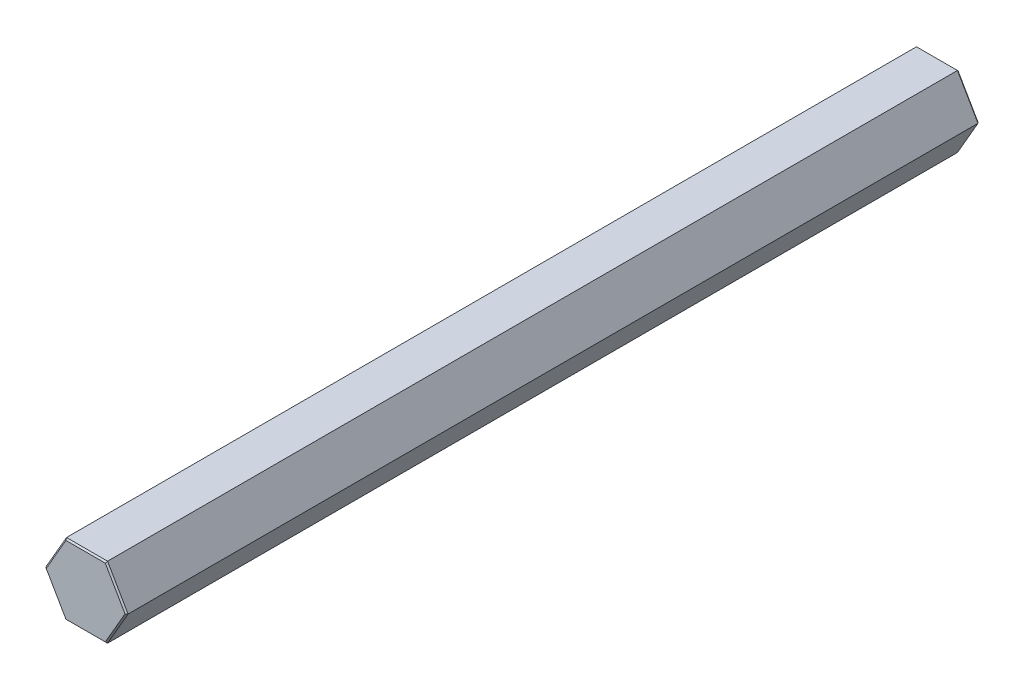
ISO-10303-21;
HEADER;
FILE_DESCRIPTION(('STEP AP214'),'2;1');
FILE_NAME('part.step','',(''),(''),'','','');
FILE_SCHEMA(('AUTOMOTIVE_DESIGN { 1 0 10303 214 1 1 1 1 }'));
ENDSEC;
DATA;
#1=APPLICATION_CONTEXT('core data for automotive mechanical design processes');
#2=APPLICATION_PROTOCOL_DEFINITION('international standard','automotive_design',2000,#1);
#3=PRODUCT_CONTEXT('',#1,'mechanical');
#4=PRODUCT('Part','Part','',(#3));
#5=PRODUCT_RELATED_PRODUCT_CATEGORY('part','',(#4));
#6=PRODUCT_DEFINITION_FORMATION('','',#4);
#7=PRODUCT_DEFINITION_CONTEXT('part definition',#1,'design');
#8=PRODUCT_DEFINITION('design','',#6,#7);
#9=PRODUCT_DEFINITION_SHAPE('','',#8);
#10=(LENGTH_UNIT() NAMED_UNIT(*) SI_UNIT(.MILLI.,.METRE.));
#11=(NAMED_UNIT(*) PLANE_ANGLE_UNIT() SI_UNIT($,.RADIAN.));
#12=(NAMED_UNIT(*) SI_UNIT($,.STERADIAN.) SOLID_ANGLE_UNIT());
#13=UNCERTAINTY_MEASURE_WITH_UNIT(LENGTH_MEASURE(1.E-05),#10,'distance_accuracy_value','');
#14=(GEOMETRIC_REPRESENTATION_CONTEXT(3) GLOBAL_UNCERTAINTY_ASSIGNED_CONTEXT((#13)) GLOBAL_UNIT_ASSIGNED_CONTEXT((#10,
#11,#12)) REPRESENTATION_CONTEXT('',''));
#15=CARTESIAN_POINT('',(0.,0.,0.));
#16=DIRECTION('',(0.,0.,1.));
#17=DIRECTION('',(1.,0.,0.));
#18=AXIS2_PLACEMENT_3D('',#15,#16,#17);
#19=CARTESIAN_POINT('',(-7.33234841870824,0.,152.4));
#20=DIRECTION('',(-0.866025403784439,0.5,0.));
#21=DIRECTION('',(-0.5,-0.866025403784439,0.));
#22=AXIS2_PLACEMENT_3D('',#19,#20,#21);
#23=PLANE('',#22);
#24=DIRECTION('',(0.,0.,-1.));
#25=VECTOR('',#24,1.);
#26=CARTESIAN_POINT('',(-3.66617420935412,6.35,152.4));
#27=LINE('',#26,#25);
#28=CARTESIAN_POINT('',(-3.66617420935412,6.35,152.146));
#29=VERTEX_POINT('',#28);
#30=CARTESIAN_POINT('',(-3.66617420935412,6.35,0.25400000000006));
#31=VERTEX_POINT('',#30);
#32=EDGE_CURVE('E156',#29,#31,#27,.T.);
#33=ORIENTED_EDGE('',*,*,#32,.T.);
#34=DIRECTION('',(-0.5,-0.866025403784439,0.));
#35=VECTOR('',#34,1.);
#36=CARTESIAN_POINT('',(-7.33234841870824,0.,0.254000000000004));
#37=LINE('',#36,#35);
#38=CARTESIAN_POINT('',(-7.33234841870824,0.,0.25400000000006));
#39=VERTEX_POINT('',#38);
#40=EDGE_CURVE('E153',#31,#39,#37,.T.);
#41=ORIENTED_EDGE('',*,*,#40,.T.);
#42=DIRECTION('',(0.,0.,-1.));
#43=VECTOR('',#42,1.);
#44=CARTESIAN_POINT('',(-7.33234841870824,0.,152.4));
#45=LINE('',#44,#43);
#46=CARTESIAN_POINT('',(-7.33234841870824,0.,152.146));
#47=VERTEX_POINT('',#46);
#48=EDGE_CURVE('E150',#47,#39,#45,.T.);
#49=ORIENTED_EDGE('',*,*,#48,.F.);
#50=DIRECTION('',(0.5,0.866025403784439,0.));
#51=VECTOR('',#50,1.);
#52=CARTESIAN_POINT('',(-3.66617420935412,6.35,152.146));
#53=LINE('',#52,#51);
#54=EDGE_CURVE('E210',#47,#29,#53,.T.);
#55=ORIENTED_EDGE('',*,*,#54,.T.);
#56=EDGE_LOOP('',(#33,#41,#49,#55));
#57=FACE_BOUND('',#56,.T.);
#58=ADVANCED_FACE('F35',(#57),#23,.T.);
#59=CARTESIAN_POINT('',(-3.66617420935412,-6.35,152.4));
#60=DIRECTION('',(-0.866025403784439,-0.5,0.));
#61=DIRECTION('',(0.5,-0.866025403784439,0.));
#62=AXIS2_PLACEMENT_3D('',#59,#60,#61);
#63=PLANE('',#62);
#64=ORIENTED_EDGE('',*,*,#48,.T.);
#65=DIRECTION('',(0.5,-0.866025403784439,0.));
#66=VECTOR('',#65,1.);
#67=CARTESIAN_POINT('',(-3.66617420935412,-6.35,0.254000000000004));
#68=LINE('',#67,#66);
#69=CARTESIAN_POINT('',(-3.66617420935412,-6.35,0.25400000000006));
#70=VERTEX_POINT('',#69);
#71=EDGE_CURVE('E194',#39,#70,#68,.T.);
#72=ORIENTED_EDGE('',*,*,#71,.T.);
#73=DIRECTION('',(0.,0.,-1.));
#74=VECTOR('',#73,1.);
#75=CARTESIAN_POINT('',(-3.66617420935412,-6.35,152.4));
#76=LINE('',#75,#74);
#77=CARTESIAN_POINT('',(-3.66617420935412,-6.35,152.146));
#78=VERTEX_POINT('',#77);
#79=EDGE_CURVE('E273',#78,#70,#76,.T.);
#80=ORIENTED_EDGE('',*,*,#79,.F.);
#81=DIRECTION('',(-0.5,0.866025403784439,0.));
#82=VECTOR('',#81,1.);
#83=CARTESIAN_POINT('',(-7.33234841870824,0.,152.146));
#84=LINE('',#83,#82);
#85=EDGE_CURVE('E200',#78,#47,#84,.T.);
#86=ORIENTED_EDGE('',*,*,#85,.T.);
#87=EDGE_LOOP('',(#64,#72,#80,#86));
#88=FACE_BOUND('',#87,.T.);
#89=ADVANCED_FACE('F276',(#88),#63,.T.);
#90=CARTESIAN_POINT('',(3.66617420935413,-6.35,152.4));
#91=DIRECTION('',(0.,-1.,0.));
#92=DIRECTION('',(0.,0.,-1.));
#93=AXIS2_PLACEMENT_3D('',#90,#91,#92);
#94=PLANE('',#93);
#95=ORIENTED_EDGE('',*,*,#79,.T.);
#96=DIRECTION('',(1.,0.,0.));
#97=VECTOR('',#96,1.);
#98=CARTESIAN_POINT('',(3.66617420935413,-6.35,0.254000000000004));
#99=LINE('',#98,#97);
#100=CARTESIAN_POINT('',(3.66617420935413,-6.35,0.25400000000006));
#101=VERTEX_POINT('',#100);
#102=EDGE_CURVE('E233',#70,#101,#99,.T.);
#103=ORIENTED_EDGE('',*,*,#102,.T.);
#104=DIRECTION('',(0.,0.,-1.));
#105=VECTOR('',#104,1.);
#106=CARTESIAN_POINT('',(3.66617420935413,-6.35,152.4));
#107=LINE('',#106,#105);
#108=CARTESIAN_POINT('',(3.66617420935413,-6.35,152.146));
#109=VERTEX_POINT('',#108);
#110=EDGE_CURVE('E250',#109,#101,#107,.T.);
#111=ORIENTED_EDGE('',*,*,#110,.F.);
#112=DIRECTION('',(-1.,0.,0.));
#113=VECTOR('',#112,1.);
#114=CARTESIAN_POINT('',(-3.66617420935412,-6.35,152.146));
#115=LINE('',#114,#113);
#116=EDGE_CURVE('E230',#109,#78,#115,.T.);
#117=ORIENTED_EDGE('',*,*,#116,.T.);
#118=EDGE_LOOP('',(#95,#103,#111,#117));
#119=FACE_BOUND('',#118,.T.);
#120=ADVANCED_FACE('F301',(#119),#94,.T.);
#121=CARTESIAN_POINT('',(7.33234841870825,0.,152.4));
#122=DIRECTION('',(0.866025403784439,-0.5,0.));
#123=DIRECTION('',(0.5,0.866025403784439,0.));
#124=AXIS2_PLACEMENT_3D('',#121,#122,#123);
#125=PLANE('',#124);
#126=ORIENTED_EDGE('',*,*,#110,.T.);
#127=DIRECTION('',(0.5,0.866025403784439,0.));
#128=VECTOR('',#127,1.);
#129=CARTESIAN_POINT('',(7.33234841870825,0.,0.254000000000004));
#130=LINE('',#129,#128);
#131=CARTESIAN_POINT('',(7.33234841870825,0.,0.25400000000006));
#132=VERTEX_POINT('',#131);
#133=EDGE_CURVE('E205',#101,#132,#130,.T.);
#134=ORIENTED_EDGE('',*,*,#133,.T.);
#135=DIRECTION('',(0.,0.,-1.));
#136=VECTOR('',#135,1.);
#137=CARTESIAN_POINT('',(7.33234841870825,0.,152.4));
#138=LINE('',#137,#136);
#139=CARTESIAN_POINT('',(7.33234841870825,0.,152.146));
#140=VERTEX_POINT('',#139);
#141=EDGE_CURVE('E249',#140,#132,#138,.T.);
#142=ORIENTED_EDGE('',*,*,#141,.F.);
#143=DIRECTION('',(-0.5,-0.866025403784439,0.));
#144=VECTOR('',#143,1.);
#145=CARTESIAN_POINT('',(3.66617420935413,-6.35,152.146));
#146=LINE('',#145,#144);
#147=EDGE_CURVE('E237',#140,#109,#146,.T.);
#148=ORIENTED_EDGE('',*,*,#147,.T.);
#149=EDGE_LOOP('',(#126,#134,#142,#148));
#150=FACE_BOUND('',#149,.T.);
#151=ADVANCED_FACE('F248',(#150),#125,.T.);
#152=CARTESIAN_POINT('',(3.66617420935413,6.35,152.4));
#153=DIRECTION('',(0.866025403784439,0.5,0.));
#154=DIRECTION('',(-0.5,0.866025403784439,0.));
#155=AXIS2_PLACEMENT_3D('',#152,#153,#154);
#156=PLANE('',#155);
#157=ORIENTED_EDGE('',*,*,#141,.T.);
#158=DIRECTION('',(-0.5,0.866025403784439,0.));
#159=VECTOR('',#158,1.);
#160=CARTESIAN_POINT('',(3.66617420935413,6.35,0.254000000000004));
#161=LINE('',#160,#159);
#162=CARTESIAN_POINT('',(3.66617420935413,6.35,0.25400000000006));
#163=VERTEX_POINT('',#162);
#164=EDGE_CURVE('E202',#132,#163,#161,.T.);
#165=ORIENTED_EDGE('',*,*,#164,.T.);
#166=DIRECTION('',(0.,0.,-1.));
#167=VECTOR('',#166,1.);
#168=CARTESIAN_POINT('',(3.66617420935413,6.35,152.4));
#169=LINE('',#168,#167);
#170=CARTESIAN_POINT('',(3.66617420935413,6.35,152.146));
#171=VERTEX_POINT('',#170);
#172=EDGE_CURVE('E259',#171,#163,#169,.T.);
#173=ORIENTED_EDGE('',*,*,#172,.F.);
#174=DIRECTION('',(0.5,-0.866025403784439,0.));
#175=VECTOR('',#174,1.);
#176=CARTESIAN_POINT('',(7.33234841870825,0.,152.146));
#177=LINE('',#176,#175);
#178=EDGE_CURVE('E199',#171,#140,#177,.T.);
#179=ORIENTED_EDGE('',*,*,#178,.T.);
#180=EDGE_LOOP('',(#157,#165,#173,#179));
#181=FACE_BOUND('',#180,.T.);
#182=ADVANCED_FACE('F255',(#181),#156,.T.);
#183=CARTESIAN_POINT('',(-3.66617420935412,6.35,152.4));
#184=DIRECTION('',(0.,1.,0.));
#185=DIRECTION('',(0.,0.,1.));
#186=AXIS2_PLACEMENT_3D('',#183,#184,#185);
#187=PLANE('',#186);
#188=ORIENTED_EDGE('',*,*,#172,.T.);
#189=DIRECTION('',(-1.,0.,0.));
#190=VECTOR('',#189,1.);
#191=CARTESIAN_POINT('',(-3.66617420935412,6.35,0.254000000000004));
#192=LINE('',#191,#190);
#193=EDGE_CURVE('E215',#163,#31,#192,.T.);
#194=ORIENTED_EDGE('',*,*,#193,.T.);
#195=ORIENTED_EDGE('',*,*,#32,.F.);
#196=DIRECTION('',(1.,0.,0.));
#197=VECTOR('',#196,1.);
#198=CARTESIAN_POINT('',(3.66617420935413,6.35,152.146));
#199=LINE('',#198,#197);
#200=EDGE_CURVE('E213',#29,#171,#199,.T.);
#201=ORIENTED_EDGE('',*,*,#200,.T.);
#202=EDGE_LOOP('',(#188,#194,#195,#201));
#203=FACE_BOUND('',#202,.T.);
#204=ADVANCED_FACE('F281',(#203),#187,.T.);
#205=CARTESIAN_POINT('',(0.,0.,152.4));
#206=DIRECTION('',(0.,0.,-1.));
#207=DIRECTION('',(-1.,0.,0.));
#208=AXIS2_PLACEMENT_3D('',#205,#206,#207);
#209=PLANE('',#208);
#210=DIRECTION('',(-0.5,-0.866025403784439,0.));
#211=VECTOR('',#210,1.);
#212=CARTESIAN_POINT('',(-7.11237796614695,-0.127000000000026,152.4));
#213=LINE('',#212,#211);
#214=CARTESIAN_POINT('',(-3.51952724097992,6.09599999999994,152.4));
#215=VERTEX_POINT('',#214);
#216=CARTESIAN_POINT('',(-7.03905448195985,0.,152.4));
#217=VERTEX_POINT('',#216);
#218=EDGE_CURVE('E60',#215,#217,#213,.T.);
#219=ORIENTED_EDGE('',*,*,#218,.T.);
#220=DIRECTION('',(0.5,-0.866025403784439,0.));
#221=VECTOR('',#220,1.);
#222=CARTESIAN_POINT('',(-3.44620375679282,-6.22299999999997,152.4));
#223=LINE('',#222,#221);
#224=CARTESIAN_POINT('',(-3.51952724097992,-6.09599999999994,152.4));
#225=VERTEX_POINT('',#224);
#226=EDGE_CURVE('E11',#217,#225,#223,.T.);
#227=ORIENTED_EDGE('',*,*,#226,.T.);
#228=DIRECTION('',(1.,0.,0.));
#229=VECTOR('',#228,1.);
#230=CARTESIAN_POINT('',(3.66617420935413,-6.09599999999994,152.4));
#231=LINE('',#230,#229);
#232=CARTESIAN_POINT('',(3.51952724097993,-6.09599999999994,152.4));
#233=VERTEX_POINT('',#232);
#234=EDGE_CURVE('E45',#225,#233,#231,.T.);
#235=ORIENTED_EDGE('',*,*,#234,.T.);
#236=DIRECTION('',(0.5,0.866025403784439,0.));
#237=VECTOR('',#236,1.);
#238=CARTESIAN_POINT('',(7.11237796614695,0.127000000000031,152.4));
#239=LINE('',#238,#237);
#240=CARTESIAN_POINT('',(7.03905448195985,0.,152.4));
#241=VERTEX_POINT('',#240);
#242=EDGE_CURVE('E221',#233,#241,#239,.T.);
#243=ORIENTED_EDGE('',*,*,#242,.T.);
#244=DIRECTION('',(-0.5,0.866025403784439,0.));
#245=VECTOR('',#244,1.);
#246=CARTESIAN_POINT('',(3.44620375679283,6.22299999999997,152.4));
#247=LINE('',#246,#245);
#248=CARTESIAN_POINT('',(3.51952724097993,6.09599999999994,152.4));
#249=VERTEX_POINT('',#248);
#250=EDGE_CURVE('E217',#241,#249,#247,.T.);
#251=ORIENTED_EDGE('',*,*,#250,.T.);
#252=DIRECTION('',(-1.,0.,0.));
#253=VECTOR('',#252,1.);
#254=CARTESIAN_POINT('',(-3.66617420935412,6.09599999999994,152.4));
#255=LINE('',#254,#253);
#256=EDGE_CURVE('E219',#249,#215,#255,.T.);
#257=ORIENTED_EDGE('',*,*,#256,.T.);
#258=EDGE_LOOP('',(#219,#227,#235,#243,#251,#257));
#259=FACE_BOUND('',#258,.T.);
#260=ADVANCED_FACE('F223',(#259),#209,.F.);
#261=CARTESIAN_POINT('',(0.,0.,0.));
#262=DIRECTION('',(0.,0.,-1.));
#263=DIRECTION('',(-1.,0.,0.));
#264=AXIS2_PLACEMENT_3D('',#261,#262,#263);
#265=PLANE('',#264);
#266=DIRECTION('',(-0.5,-0.866025403784439,0.));
#267=VECTOR('',#266,1.);
#268=CARTESIAN_POINT('',(5.27929086146992,-3.04799999999999,0.));
#269=LINE('',#268,#267);
#270=CARTESIAN_POINT('',(7.0390544819599,0.,0.));
#271=VERTEX_POINT('',#270);
#272=CARTESIAN_POINT('',(3.51952724097995,-6.09599999999998,0.));
#273=VERTEX_POINT('',#272);
#274=EDGE_CURVE('E239',#271,#273,#269,.T.);
#275=ORIENTED_EDGE('',*,*,#274,.T.);
#276=DIRECTION('',(-1.,0.,0.));
#277=VECTOR('',#276,1.);
#278=CARTESIAN_POINT('',(0.,-6.09599999999998,0.));
#279=LINE('',#278,#277);
#280=CARTESIAN_POINT('',(-3.51952724097994,-6.09599999999998,0.));
#281=VERTEX_POINT('',#280);
#282=EDGE_CURVE('E234',#273,#281,#279,.T.);
#283=ORIENTED_EDGE('',*,*,#282,.T.);
#284=DIRECTION('',(-0.5,0.866025403784439,0.));
#285=VECTOR('',#284,1.);
#286=CARTESIAN_POINT('',(-5.27929086146992,-3.04799999999999,0.));
#287=LINE('',#286,#285);
#288=CARTESIAN_POINT('',(-7.03905448195989,0.,0.));
#289=VERTEX_POINT('',#288);
#290=EDGE_CURVE('E134',#281,#289,#287,.T.);
#291=ORIENTED_EDGE('',*,*,#290,.T.);
#292=DIRECTION('',(0.5,0.866025403784439,0.));
#293=VECTOR('',#292,1.);
#294=CARTESIAN_POINT('',(-5.27929086146992,3.04799999999999,0.));
#295=LINE('',#294,#293);
#296=CARTESIAN_POINT('',(-3.51952724097994,6.09599999999998,0.));
#297=VERTEX_POINT('',#296);
#298=EDGE_CURVE('E127',#289,#297,#295,.T.);
#299=ORIENTED_EDGE('',*,*,#298,.T.);
#300=DIRECTION('',(1.,0.,0.));
#301=VECTOR('',#300,1.);
#302=CARTESIAN_POINT('',(0.,6.09599999999998,0.));
#303=LINE('',#302,#301);
#304=CARTESIAN_POINT('',(3.51952724097995,6.09599999999998,0.));
#305=VERTEX_POINT('',#304);
#306=EDGE_CURVE('E130',#297,#305,#303,.T.);
#307=ORIENTED_EDGE('',*,*,#306,.T.);
#308=DIRECTION('',(0.5,-0.866025403784439,0.));
#309=VECTOR('',#308,1.);
#310=CARTESIAN_POINT('',(5.27929086146993,3.04799999999999,0.));
#311=LINE('',#310,#309);
#312=EDGE_CURVE('E139',#305,#271,#311,.T.);
#313=ORIENTED_EDGE('',*,*,#312,.T.);
#314=EDGE_LOOP('',(#275,#283,#291,#299,#307,#313));
#315=FACE_BOUND('',#314,.T.);
#316=ADVANCED_FACE('F129',(#315),#265,.T.);
#317=CARTESIAN_POINT('',(0.,6.09599999999998,0.));
#318=DIRECTION('',(0.,-0.707106781186528,0.707106781186567));
#319=DIRECTION('',(1.,0.,0.));
#320=AXIS2_PLACEMENT_3D('',#317,#318,#319);
#321=PLANE('',#320);
#322=DIRECTION('',(-0.377964473009234,0.654653670707993,0.654653670707957));
#323=VECTOR('',#322,1.);
#324=CARTESIAN_POINT('',(-3.01673763512565,5.22514285714281,-0.870857142857128));
#325=LINE('',#324,#323);
#326=EDGE_CURVE('E145',#31,#297,#325,.F.);
#327=ORIENTED_EDGE('',*,*,#326,.F.);
#328=ORIENTED_EDGE('',*,*,#193,.F.);
#329=DIRECTION('',(-0.377964473009238,-0.654653670707992,-0.654653670707956));
#330=VECTOR('',#329,1.);
#331=CARTESIAN_POINT('',(3.01673763512565,5.2251428571428,-0.870857142857138));
#332=LINE('',#331,#330);
#333=EDGE_CURVE('E148',#305,#163,#332,.F.);
#334=ORIENTED_EDGE('',*,*,#333,.F.);
#335=ORIENTED_EDGE('',*,*,#306,.F.);
#336=EDGE_LOOP('',(#327,#328,#334,#335));
#337=FACE_BOUND('',#336,.T.);
#338=ADVANCED_FACE('F143',(#337),#321,.F.);
#339=CARTESIAN_POINT('',(5.27929086146993,3.04799999999999,0.));
#340=DIRECTION('',(-0.612372435695777,-0.353553390593263,0.707106781186568));
#341=DIRECTION('',(0.5,-0.866025403784439,0.));
#342=AXIS2_PLACEMENT_3D('',#339,#340,#341);
#343=PLANE('',#342);
#344=ORIENTED_EDGE('',*,*,#333,.T.);
#345=ORIENTED_EDGE('',*,*,#164,.F.);
#346=DIRECTION('',(-0.755928946018472,0.,-0.654653670707956));
#347=VECTOR('',#346,1.);
#348=CARTESIAN_POINT('',(6.0334752702513,0.,-0.87085714285713));
#349=LINE('',#348,#347);
#350=EDGE_CURVE('E154',#271,#132,#349,.F.);
#351=ORIENTED_EDGE('',*,*,#350,.F.);
#352=ORIENTED_EDGE('',*,*,#312,.F.);
#353=EDGE_LOOP('',(#344,#345,#351,#352));
#354=FACE_BOUND('',#353,.T.);
#355=ADVANCED_FACE('F263',(#354),#343,.F.);
#356=CARTESIAN_POINT('',(-5.27929086146992,3.04799999999999,0.));
#357=DIRECTION('',(0.612372435695779,-0.353553390593265,0.707106781186566));
#358=DIRECTION('',(0.5,0.866025403784439,0.));
#359=AXIS2_PLACEMENT_3D('',#356,#357,#358);
#360=PLANE('',#359);
#361=ORIENTED_EDGE('',*,*,#326,.T.);
#362=ORIENTED_EDGE('',*,*,#298,.F.);
#363=DIRECTION('',(-0.755928946018473,0.,0.654653670707956));
#364=VECTOR('',#363,1.);
#365=CARTESIAN_POINT('',(-6.03347527025127,0.,-0.870857142857144));
#366=LINE('',#365,#364);
#367=EDGE_CURVE('E159',#39,#289,#366,.F.);
#368=ORIENTED_EDGE('',*,*,#367,.F.);
#369=ORIENTED_EDGE('',*,*,#40,.F.);
#370=EDGE_LOOP('',(#361,#362,#368,#369));
#371=FACE_BOUND('',#370,.T.);
#372=ADVANCED_FACE('F152',(#371),#360,.F.);
#373=CARTESIAN_POINT('',(5.27929086146992,-3.04799999999999,0.));
#374=DIRECTION('',(-0.612372435695778,0.353553390593264,0.707106781186567));
#375=DIRECTION('',(-0.5,-0.866025403784439,0.));
#376=AXIS2_PLACEMENT_3D('',#373,#374,#375);
#377=PLANE('',#376);
#378=ORIENTED_EDGE('',*,*,#350,.T.);
#379=ORIENTED_EDGE('',*,*,#133,.F.);
#380=DIRECTION('',(-0.377964473009237,0.654653670707992,-0.654653670707957));
#381=VECTOR('',#380,1.);
#382=CARTESIAN_POINT('',(3.01673763512565,-5.2251428571428,-0.870857142857133));
#383=LINE('',#382,#381);
#384=EDGE_CURVE('E183',#273,#101,#383,.F.);
#385=ORIENTED_EDGE('',*,*,#384,.F.);
#386=ORIENTED_EDGE('',*,*,#274,.F.);
#387=EDGE_LOOP('',(#378,#379,#385,#386));
#388=FACE_BOUND('',#387,.T.);
#389=ADVANCED_FACE('F265',(#388),#377,.F.);
#390=CARTESIAN_POINT('',(-5.27929086146992,-3.04799999999999,0.));
#391=DIRECTION('',(0.612372435695776,0.353553390593263,0.707106781186569));
#392=DIRECTION('',(-0.5,0.866025403784439,0.));
#393=AXIS2_PLACEMENT_3D('',#390,#391,#392);
#394=PLANE('',#393);
#395=ORIENTED_EDGE('',*,*,#367,.T.);
#396=ORIENTED_EDGE('',*,*,#290,.F.);
#397=DIRECTION('',(-0.37796447300924,-0.654653670707991,0.654653670707956));
#398=VECTOR('',#397,1.);
#399=CARTESIAN_POINT('',(-3.01673763512564,-5.22514285714281,-0.870857142857126));
#400=LINE('',#399,#398);
#401=EDGE_CURVE('E178',#70,#281,#400,.F.);
#402=ORIENTED_EDGE('',*,*,#401,.F.);
#403=ORIENTED_EDGE('',*,*,#71,.F.);
#404=EDGE_LOOP('',(#395,#396,#402,#403));
#405=FACE_BOUND('',#404,.T.);
#406=ADVANCED_FACE('F193',(#405),#394,.F.);
#407=CARTESIAN_POINT('',(0.,-6.09599999999998,0.));
#408=DIRECTION('',(0.,0.707106781186528,0.707106781186567));
#409=DIRECTION('',(-1.,0.,0.));
#410=AXIS2_PLACEMENT_3D('',#407,#408,#409);
#411=PLANE('',#410);
#412=ORIENTED_EDGE('',*,*,#384,.T.);
#413=ORIENTED_EDGE('',*,*,#102,.F.);
#414=ORIENTED_EDGE('',*,*,#401,.T.);
#415=ORIENTED_EDGE('',*,*,#282,.F.);
#416=EDGE_LOOP('',(#412,#413,#414,#415));
#417=FACE_BOUND('',#416,.T.);
#418=ADVANCED_FACE('F307',(#417),#411,.F.);
#419=CARTESIAN_POINT('',(3.66617420935413,6.35,152.146));
#420=DIRECTION('',(0.612372435695798,0.353553390593276,0.707106781186543));
#421=DIRECTION('',(-0.5,0.866025403784439,0.));
#422=AXIS2_PLACEMENT_3D('',#419,#420,#421);
#423=PLANE('',#422);
#424=DIRECTION('',(-0.377964473009228,-0.654653670707971,0.654653670707983));
#425=VECTOR('',#424,1.);
#426=CARTESIAN_POINT('',(3.66617420935413,6.35,152.146));
#427=LINE('',#426,#425);
#428=EDGE_CURVE('E171',#249,#171,#427,.F.);
#429=ORIENTED_EDGE('',*,*,#428,.F.);
#430=ORIENTED_EDGE('',*,*,#250,.F.);
#431=DIRECTION('',(0.75592894601845,0.,-0.654653670707983));
#432=VECTOR('',#431,1.);
#433=CARTESIAN_POINT('',(5.23739172764879,0.,153.960285714286));
#434=LINE('',#433,#432);
#435=EDGE_CURVE('E40',#140,#241,#434,.F.);
#436=ORIENTED_EDGE('',*,*,#435,.F.);
#437=ORIENTED_EDGE('',*,*,#178,.F.);
#438=EDGE_LOOP('',(#429,#430,#436,#437));
#439=FACE_BOUND('',#438,.T.);
#440=ADVANCED_FACE('F38',(#439),#423,.T.);
#441=CARTESIAN_POINT('',(7.33234841870825,0.,152.146));
#442=DIRECTION('',(0.6123724356958,-0.353553390593277,0.707106781186541));
#443=DIRECTION('',(0.5,0.866025403784439,0.));
#444=AXIS2_PLACEMENT_3D('',#441,#442,#443);
#445=PLANE('',#444);
#446=ORIENTED_EDGE('',*,*,#435,.T.);
#447=ORIENTED_EDGE('',*,*,#242,.F.);
#448=DIRECTION('',(0.377964473009224,-0.654653670707972,-0.654653670707984));
#449=VECTOR('',#448,1.);
#450=CARTESIAN_POINT('',(2.61869586382439,-4.53571428571431,153.960285714286));
#451=LINE('',#450,#449);
#452=EDGE_CURVE('E169',#109,#233,#451,.F.);
#453=ORIENTED_EDGE('',*,*,#452,.F.);
#454=ORIENTED_EDGE('',*,*,#147,.F.);
#455=EDGE_LOOP('',(#446,#447,#453,#454));
#456=FACE_BOUND('',#455,.T.);
#457=ADVANCED_FACE('F227',(#456),#445,.T.);
#458=CARTESIAN_POINT('',(-3.66617420935412,6.35,152.146));
#459=DIRECTION('',(0.,0.707106781186554,0.707106781186541));
#460=DIRECTION('',(-1.,0.,0.));
#461=AXIS2_PLACEMENT_3D('',#458,#459,#460);
#462=PLANE('',#461);
#463=ORIENTED_EDGE('',*,*,#428,.T.);
#464=ORIENTED_EDGE('',*,*,#200,.F.);
#465=DIRECTION('',(0.377964473009224,-0.654653670707973,0.654653670707984));
#466=VECTOR('',#465,1.);
#467=CARTESIAN_POINT('',(-3.66617420935412,6.35,152.146));
#468=LINE('',#467,#466);
#469=EDGE_CURVE('E166',#215,#29,#468,.F.);
#470=ORIENTED_EDGE('',*,*,#469,.F.);
#471=ORIENTED_EDGE('',*,*,#256,.F.);
#472=EDGE_LOOP('',(#463,#464,#470,#471));
#473=FACE_BOUND('',#472,.T.);
#474=ADVANCED_FACE('F283',(#473),#462,.T.);
#475=CARTESIAN_POINT('',(3.66617420935413,-6.35,152.146));
#476=DIRECTION('',(0.,-0.707106781186554,0.707106781186541));
#477=DIRECTION('',(1.,0.,0.));
#478=AXIS2_PLACEMENT_3D('',#475,#476,#477);
#479=PLANE('',#478);
#480=ORIENTED_EDGE('',*,*,#452,.T.);
#481=ORIENTED_EDGE('',*,*,#234,.F.);
#482=DIRECTION('',(-0.377964473009226,-0.654653670707972,-0.654653670707983));
#483=VECTOR('',#482,1.);
#484=CARTESIAN_POINT('',(-2.61869586382438,-4.53571428571431,153.960285714286));
#485=LINE('',#484,#483);
#486=EDGE_CURVE('E53',#78,#225,#485,.F.);
#487=ORIENTED_EDGE('',*,*,#486,.F.);
#488=ORIENTED_EDGE('',*,*,#116,.F.);
#489=EDGE_LOOP('',(#480,#481,#487,#488));
#490=FACE_BOUND('',#489,.T.);
#491=ADVANCED_FACE('F229',(#490),#479,.T.);
#492=CARTESIAN_POINT('',(-7.33234841870824,0.,152.146));
#493=DIRECTION('',(-0.6123724356958,0.353553390593277,0.707106781186541));
#494=DIRECTION('',(-0.5,-0.866025403784439,0.));
#495=AXIS2_PLACEMENT_3D('',#492,#493,#494);
#496=PLANE('',#495);
#497=ORIENTED_EDGE('',*,*,#469,.T.);
#498=ORIENTED_EDGE('',*,*,#54,.F.);
#499=DIRECTION('',(0.755928946018449,0.,0.654653670707984));
#500=VECTOR('',#499,1.);
#501=CARTESIAN_POINT('',(-7.33234841870824,0.,152.146));
#502=LINE('',#501,#500);
#503=EDGE_CURVE('E163',#217,#47,#502,.F.);
#504=ORIENTED_EDGE('',*,*,#503,.F.);
#505=ORIENTED_EDGE('',*,*,#218,.F.);
#506=EDGE_LOOP('',(#497,#498,#504,#505));
#507=FACE_BOUND('',#506,.T.);
#508=ADVANCED_FACE('F285',(#507),#496,.T.);
#509=CARTESIAN_POINT('',(-3.66617420935412,-6.35,152.146));
#510=DIRECTION('',(-0.612372435695799,-0.353553390593276,0.707106781186542));
#511=DIRECTION('',(0.5,-0.866025403784439,0.));
#512=AXIS2_PLACEMENT_3D('',#509,#510,#511);
#513=PLANE('',#512);
#514=ORIENTED_EDGE('',*,*,#486,.T.);
#515=ORIENTED_EDGE('',*,*,#226,.F.);
#516=ORIENTED_EDGE('',*,*,#503,.T.);
#517=ORIENTED_EDGE('',*,*,#85,.F.);
#518=EDGE_LOOP('',(#514,#515,#516,#517));
#519=FACE_BOUND('',#518,.T.);
#520=ADVANCED_FACE('F287',(#519),#513,.T.);
#521=CLOSED_SHELL('',(#58,#89,#120,#151,#182,#204,#260,#316,#338,#355,#372,#389,#406,#418,#440,
#457,#474,#491,#508,#520));
#522=MANIFOLD_SOLID_BREP('B2',#521);
#523=ADVANCED_BREP_SHAPE_REPRESENTATION('',(#18,#522),#14);
#524=SHAPE_DEFINITION_REPRESENTATION(#9,#523);
ENDSEC;
END-ISO-10303-21;
